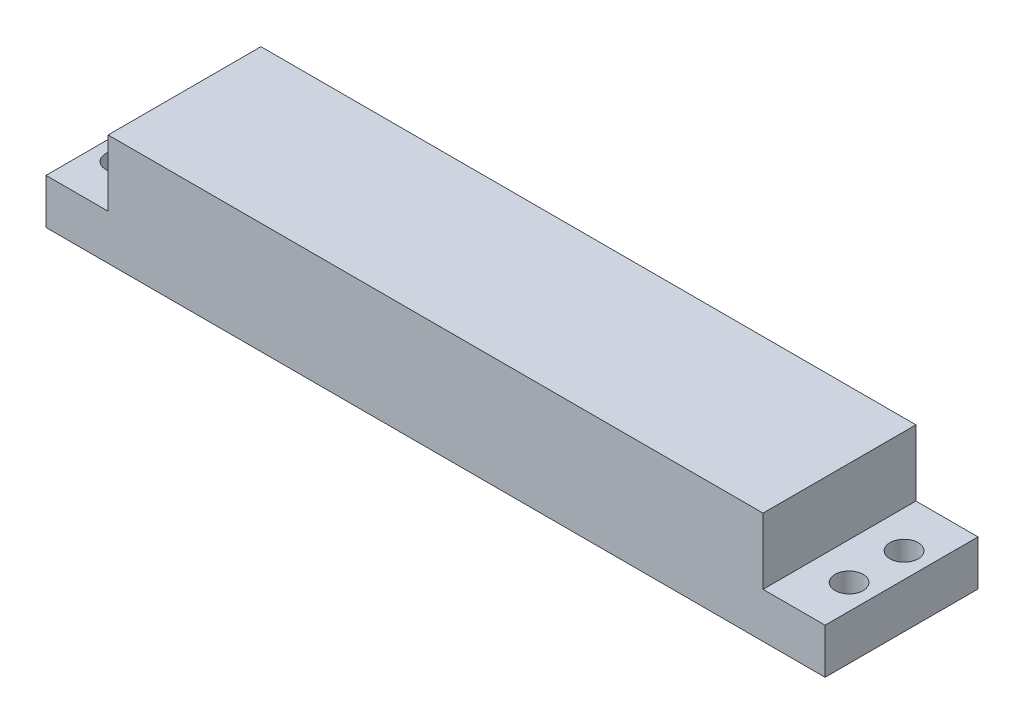
ISO-10303-21;
HEADER;
FILE_DESCRIPTION(('STEP AP214'),'2;1');
FILE_NAME('part.step','',(''),(''),'','','');
FILE_SCHEMA(('AUTOMOTIVE_DESIGN { 1 0 10303 214 1 1 1 1 }'));
ENDSEC;
DATA;
#1=APPLICATION_CONTEXT('core data for automotive mechanical design processes');
#2=APPLICATION_PROTOCOL_DEFINITION('international standard','automotive_design',2000,#1);
#3=PRODUCT_CONTEXT('',#1,'mechanical');
#4=PRODUCT('Part','Part','',(#3));
#5=PRODUCT_RELATED_PRODUCT_CATEGORY('part','',(#4));
#6=PRODUCT_DEFINITION_FORMATION('','',#4);
#7=PRODUCT_DEFINITION_CONTEXT('part definition',#1,'design');
#8=PRODUCT_DEFINITION('design','',#6,#7);
#9=PRODUCT_DEFINITION_SHAPE('','',#8);
#10=(LENGTH_UNIT() NAMED_UNIT(*) SI_UNIT(.MILLI.,.METRE.));
#11=(NAMED_UNIT(*) PLANE_ANGLE_UNIT() SI_UNIT($,.RADIAN.));
#12=(NAMED_UNIT(*) SI_UNIT($,.STERADIAN.) SOLID_ANGLE_UNIT());
#13=UNCERTAINTY_MEASURE_WITH_UNIT(LENGTH_MEASURE(1.E-05),#10,'distance_accuracy_value','');
#14=(GEOMETRIC_REPRESENTATION_CONTEXT(3) GLOBAL_UNCERTAINTY_ASSIGNED_CONTEXT((#13)) GLOBAL_UNIT_ASSIGNED_CONTEXT((#10,
#11,#12)) REPRESENTATION_CONTEXT('',''));
#15=CARTESIAN_POINT('',(0.,0.,0.));
#16=DIRECTION('',(0.,0.,1.));
#17=DIRECTION('',(1.,0.,0.));
#18=AXIS2_PLACEMENT_3D('',#15,#16,#17);
#19=CARTESIAN_POINT('',(0.,6.5,0.));
#20=DIRECTION('',(0.,-1.,0.));
#21=DIRECTION('',(0.,0.,-1.));
#22=AXIS2_PLACEMENT_3D('',#19,#20,#21);
#23=PLANE('',#22);
#24=CARTESIAN_POINT('',(-52.455,6.5,-3.955));
#25=DIRECTION('',(0.,1.,0.));
#26=DIRECTION('',(0.,0.,1.));
#27=AXIS2_PLACEMENT_3D('',#24,#25,#26);
#28=CIRCLE('',#27,2.025);
#29=CARTESIAN_POINT('',(-52.455,6.5,-1.93));
#30=VERTEX_POINT('',#29);
#31=EDGE_CURVE('E166',#30,#30,#28,.T.);
#32=ORIENTED_EDGE('',*,*,#31,.F.);
#33=EDGE_LOOP('',(#32));
#34=FACE_BOUND('',#33,.T.);
#35=CARTESIAN_POINT('',(-52.455,6.5,3.955));
#36=DIRECTION('',(0.,1.,0.));
#37=DIRECTION('',(0.,0.,1.));
#38=AXIS2_PLACEMENT_3D('',#35,#36,#37);
#39=CIRCLE('',#38,2.025);
#40=CARTESIAN_POINT('',(-52.455,6.5,5.98));
#41=VERTEX_POINT('',#40);
#42=EDGE_CURVE('E182',#41,#41,#39,.T.);
#43=ORIENTED_EDGE('',*,*,#42,.F.);
#44=EDGE_LOOP('',(#43));
#45=FACE_BOUND('',#44,.T.);
#46=DIRECTION('',(0.,0.,1.));
#47=VECTOR('',#46,1.);
#48=CARTESIAN_POINT('',(-47.119931018186,6.5,11.));
#49=LINE('',#48,#47);
#50=CARTESIAN_POINT('',(-47.119931018186,6.5,-11.));
#51=VERTEX_POINT('',#50);
#52=CARTESIAN_POINT('',(-47.119931018186,6.5,11.));
#53=VERTEX_POINT('',#52);
#54=EDGE_CURVE('E138',#51,#53,#49,.T.);
#55=ORIENTED_EDGE('',*,*,#54,.F.);
#56=DIRECTION('',(-1.,0.,0.));
#57=VECTOR('',#56,1.);
#58=CARTESIAN_POINT('',(-56.05,6.5,-11.));
#59=LINE('',#58,#57);
#60=CARTESIAN_POINT('',(-56.05,6.5,-11.));
#61=VERTEX_POINT('',#60);
#62=EDGE_CURVE('E120',#51,#61,#59,.T.);
#63=ORIENTED_EDGE('',*,*,#62,.T.);
#64=DIRECTION('',(0.,0.,1.));
#65=VECTOR('',#64,1.);
#66=CARTESIAN_POINT('',(-56.05,6.5,11.));
#67=LINE('',#66,#65);
#68=CARTESIAN_POINT('',(-56.05,6.5,11.));
#69=VERTEX_POINT('',#68);
#70=EDGE_CURVE('E119',#61,#69,#67,.T.);
#71=ORIENTED_EDGE('',*,*,#70,.T.);
#72=DIRECTION('',(1.,0.,0.));
#73=VECTOR('',#72,1.);
#74=CARTESIAN_POINT('',(-56.05,6.5,11.));
#75=LINE('',#74,#73);
#76=EDGE_CURVE('E71',#69,#53,#75,.T.);
#77=ORIENTED_EDGE('',*,*,#76,.T.);
#78=EDGE_LOOP('',(#55,#63,#71,#77));
#79=FACE_BOUND('',#78,.T.);
#80=ADVANCED_FACE('F47',(#34,#45,#79),#23,.F.);
#81=CARTESIAN_POINT('',(52.455,6.5,-3.955));
#82=DIRECTION('',(0.,1.,0.));
#83=DIRECTION('',(0.,0.,1.));
#84=AXIS2_PLACEMENT_3D('',#81,#82,#83);
#85=CIRCLE('',#84,2.025);
#86=CARTESIAN_POINT('',(52.455,6.5,-1.93));
#87=VERTEX_POINT('',#86);
#88=EDGE_CURVE('E156',#87,#87,#85,.T.);
#89=ORIENTED_EDGE('',*,*,#88,.F.);
#90=EDGE_LOOP('',(#89));
#91=FACE_BOUND('',#90,.T.);
#92=CARTESIAN_POINT('',(52.455,6.5,3.955));
#93=DIRECTION('',(0.,1.,0.));
#94=DIRECTION('',(0.,0.,1.));
#95=AXIS2_PLACEMENT_3D('',#92,#93,#94);
#96=CIRCLE('',#95,2.025);
#97=CARTESIAN_POINT('',(52.455,6.5,5.98));
#98=VERTEX_POINT('',#97);
#99=EDGE_CURVE('E174',#98,#98,#96,.T.);
#100=ORIENTED_EDGE('',*,*,#99,.F.);
#101=EDGE_LOOP('',(#100));
#102=FACE_BOUND('',#101,.T.);
#103=DIRECTION('',(0.,0.,-1.));
#104=VECTOR('',#103,1.);
#105=CARTESIAN_POINT('',(47.119931018186,6.5,11.));
#106=LINE('',#105,#104);
#107=CARTESIAN_POINT('',(47.119931018186,6.5,11.));
#108=VERTEX_POINT('',#107);
#109=CARTESIAN_POINT('',(47.119931018186,6.5,-11.));
#110=VERTEX_POINT('',#109);
#111=EDGE_CURVE('E63',#108,#110,#106,.T.);
#112=ORIENTED_EDGE('',*,*,#111,.F.);
#113=CARTESIAN_POINT('',(56.05,6.5,11.));
#114=VERTEX_POINT('',#113);
#115=EDGE_CURVE('E195',#108,#114,#75,.T.);
#116=ORIENTED_EDGE('',*,*,#115,.T.);
#117=DIRECTION('',(0.,0.,-1.));
#118=VECTOR('',#117,1.);
#119=CARTESIAN_POINT('',(56.05,6.5,11.));
#120=LINE('',#119,#118);
#121=CARTESIAN_POINT('',(56.05,6.5,-11.));
#122=VERTEX_POINT('',#121);
#123=EDGE_CURVE('E115',#114,#122,#120,.T.);
#124=ORIENTED_EDGE('',*,*,#123,.T.);
#125=EDGE_CURVE('E111',#122,#110,#59,.T.);
#126=ORIENTED_EDGE('',*,*,#125,.T.);
#127=EDGE_LOOP('',(#112,#116,#124,#126));
#128=FACE_BOUND('',#127,.T.);
#129=ADVANCED_FACE('F113',(#91,#102,#128),#23,.F.);
#130=CARTESIAN_POINT('',(0.,0.,0.));
#131=DIRECTION('',(0.,-1.,0.));
#132=DIRECTION('',(0.,0.,-1.));
#133=AXIS2_PLACEMENT_3D('',#130,#131,#132);
#134=PLANE('',#133);
#135=CARTESIAN_POINT('',(-52.455,0.,-3.955));
#136=DIRECTION('',(0.,1.,0.));
#137=DIRECTION('',(0.,0.,1.));
#138=AXIS2_PLACEMENT_3D('',#135,#136,#137);
#139=CIRCLE('',#138,2.025);
#140=CARTESIAN_POINT('',(-52.455,0.,-1.93));
#141=VERTEX_POINT('',#140);
#142=EDGE_CURVE('E160',#141,#141,#139,.T.);
#143=ORIENTED_EDGE('',*,*,#142,.T.);
#144=EDGE_LOOP('',(#143));
#145=FACE_BOUND('',#144,.T.);
#146=CARTESIAN_POINT('',(-52.455,0.,3.955));
#147=DIRECTION('',(0.,1.,0.));
#148=DIRECTION('',(0.,0.,1.));
#149=AXIS2_PLACEMENT_3D('',#146,#147,#148);
#150=CIRCLE('',#149,2.025);
#151=CARTESIAN_POINT('',(-52.455,0.,5.98));
#152=VERTEX_POINT('',#151);
#153=EDGE_CURVE('E178',#152,#152,#150,.T.);
#154=ORIENTED_EDGE('',*,*,#153,.T.);
#155=EDGE_LOOP('',(#154));
#156=FACE_BOUND('',#155,.T.);
#157=DIRECTION('',(0.,0.,-1.));
#158=VECTOR('',#157,1.);
#159=CARTESIAN_POINT('',(56.05,0.,11.));
#160=LINE('',#159,#158);
#161=CARTESIAN_POINT('',(56.05,0.,11.));
#162=VERTEX_POINT('',#161);
#163=CARTESIAN_POINT('',(56.05,0.,-11.));
#164=VERTEX_POINT('',#163);
#165=EDGE_CURVE('E186',#162,#164,#160,.T.);
#166=ORIENTED_EDGE('',*,*,#165,.F.);
#167=DIRECTION('',(1.,0.,0.));
#168=VECTOR('',#167,1.);
#169=CARTESIAN_POINT('',(-56.05,0.,11.));
#170=LINE('',#169,#168);
#171=CARTESIAN_POINT('',(-56.05,0.,11.));
#172=VERTEX_POINT('',#171);
#173=EDGE_CURVE('E191',#172,#162,#170,.T.);
#174=ORIENTED_EDGE('',*,*,#173,.F.);
#175=DIRECTION('',(0.,0.,1.));
#176=VECTOR('',#175,1.);
#177=CARTESIAN_POINT('',(-56.05,0.,11.));
#178=LINE('',#177,#176);
#179=CARTESIAN_POINT('',(-56.05,0.,-11.));
#180=VERTEX_POINT('',#179);
#181=EDGE_CURVE('E205',#180,#172,#178,.T.);
#182=ORIENTED_EDGE('',*,*,#181,.F.);
#183=DIRECTION('',(-1.,0.,0.));
#184=VECTOR('',#183,1.);
#185=CARTESIAN_POINT('',(-56.05,0.,-11.));
#186=LINE('',#185,#184);
#187=EDGE_CURVE('E202',#164,#180,#186,.T.);
#188=ORIENTED_EDGE('',*,*,#187,.F.);
#189=EDGE_LOOP('',(#166,#174,#182,#188));
#190=FACE_BOUND('',#189,.T.);
#191=CARTESIAN_POINT('',(52.455,0.,3.955));
#192=DIRECTION('',(0.,1.,0.));
#193=DIRECTION('',(0.,0.,1.));
#194=AXIS2_PLACEMENT_3D('',#191,#192,#193);
#195=CIRCLE('',#194,2.025);
#196=CARTESIAN_POINT('',(52.455,0.,5.98));
#197=VERTEX_POINT('',#196);
#198=EDGE_CURVE('E170',#197,#197,#195,.T.);
#199=ORIENTED_EDGE('',*,*,#198,.T.);
#200=EDGE_LOOP('',(#199));
#201=FACE_BOUND('',#200,.T.);
#202=CARTESIAN_POINT('',(52.455,0.,-3.955));
#203=DIRECTION('',(0.,1.,0.));
#204=DIRECTION('',(0.,0.,1.));
#205=AXIS2_PLACEMENT_3D('',#202,#203,#204);
#206=CIRCLE('',#205,2.025);
#207=CARTESIAN_POINT('',(52.455,0.,-1.93));
#208=VERTEX_POINT('',#207);
#209=EDGE_CURVE('E161',#208,#208,#206,.T.);
#210=ORIENTED_EDGE('',*,*,#209,.T.);
#211=EDGE_LOOP('',(#210));
#212=FACE_BOUND('',#211,.T.);
#213=ADVANCED_FACE('F228',(#145,#156,#190,#201,#212),#134,.T.);
#214=CARTESIAN_POINT('',(56.05,6.5,11.));
#215=DIRECTION('',(-1.,0.,0.));
#216=DIRECTION('',(0.,0.,1.));
#217=AXIS2_PLACEMENT_3D('',#214,#215,#216);
#218=PLANE('',#217);
#219=ORIENTED_EDGE('',*,*,#165,.T.);
#220=DIRECTION('',(0.,-1.,0.));
#221=VECTOR('',#220,1.);
#222=CARTESIAN_POINT('',(56.05,6.5,-11.));
#223=LINE('',#222,#221);
#224=EDGE_CURVE('E12',#122,#164,#223,.T.);
#225=ORIENTED_EDGE('',*,*,#224,.F.);
#226=ORIENTED_EDGE('',*,*,#123,.F.);
#227=DIRECTION('',(0.,-1.,0.));
#228=VECTOR('',#227,1.);
#229=CARTESIAN_POINT('',(56.05,6.5,11.));
#230=LINE('',#229,#228);
#231=EDGE_CURVE('E198',#114,#162,#230,.T.);
#232=ORIENTED_EDGE('',*,*,#231,.T.);
#233=EDGE_LOOP('',(#219,#225,#226,#232));
#234=FACE_BOUND('',#233,.T.);
#235=ADVANCED_FACE('F49',(#234),#218,.F.);
#236=CARTESIAN_POINT('',(-56.05,6.5,-11.));
#237=DIRECTION('',(0.,0.,1.));
#238=DIRECTION('',(1.,0.,0.));
#239=AXIS2_PLACEMENT_3D('',#236,#237,#238);
#240=PLANE('',#239);
#241=ORIENTED_EDGE('',*,*,#187,.T.);
#242=DIRECTION('',(0.,-1.,0.));
#243=VECTOR('',#242,1.);
#244=CARTESIAN_POINT('',(-56.05,6.5,-11.));
#245=LINE('',#244,#243);
#246=EDGE_CURVE('E56',#61,#180,#245,.T.);
#247=ORIENTED_EDGE('',*,*,#246,.F.);
#248=ORIENTED_EDGE('',*,*,#62,.F.);
#249=DIRECTION('',(0.,-1.,0.));
#250=VECTOR('',#249,1.);
#251=CARTESIAN_POINT('',(-47.119931018186,128.773713355613,-11.));
#252=LINE('',#251,#250);
#253=CARTESIAN_POINT('',(-47.119931018186,16.,-11.));
#254=VERTEX_POINT('',#253);
#255=EDGE_CURVE('E132',#254,#51,#252,.T.);
#256=ORIENTED_EDGE('',*,*,#255,.F.);
#257=DIRECTION('',(1.,0.,0.));
#258=VECTOR('',#257,1.);
#259=CARTESIAN_POINT('',(47.119931018186,16.,-11.));
#260=LINE('',#259,#258);
#261=CARTESIAN_POINT('',(47.119931018186,16.,-11.));
#262=VERTEX_POINT('',#261);
#263=EDGE_CURVE('E127',#254,#262,#260,.T.);
#264=ORIENTED_EDGE('',*,*,#263,.T.);
#265=DIRECTION('',(0.,-1.,0.));
#266=VECTOR('',#265,1.);
#267=CARTESIAN_POINT('',(47.119931018186,128.773713355613,-11.));
#268=LINE('',#267,#266);
#269=EDGE_CURVE('E124',#262,#110,#268,.T.);
#270=ORIENTED_EDGE('',*,*,#269,.T.);
#271=ORIENTED_EDGE('',*,*,#125,.F.);
#272=ORIENTED_EDGE('',*,*,#224,.T.);
#273=EDGE_LOOP('',(#241,#247,#248,#256,#264,#270,#271,#272));
#274=FACE_BOUND('',#273,.T.);
#275=ADVANCED_FACE('F125',(#274),#240,.F.);
#276=CARTESIAN_POINT('',(-56.05,6.5,11.));
#277=DIRECTION('',(1.,0.,0.));
#278=DIRECTION('',(0.,0.,-1.));
#279=AXIS2_PLACEMENT_3D('',#276,#277,#278);
#280=PLANE('',#279);
#281=ORIENTED_EDGE('',*,*,#181,.T.);
#282=DIRECTION('',(0.,-1.,0.));
#283=VECTOR('',#282,1.);
#284=CARTESIAN_POINT('',(-56.05,6.5,11.));
#285=LINE('',#284,#283);
#286=EDGE_CURVE('E213',#69,#172,#285,.T.);
#287=ORIENTED_EDGE('',*,*,#286,.F.);
#288=ORIENTED_EDGE('',*,*,#70,.F.);
#289=ORIENTED_EDGE('',*,*,#246,.T.);
#290=EDGE_LOOP('',(#281,#287,#288,#289));
#291=FACE_BOUND('',#290,.T.);
#292=ADVANCED_FACE('F222',(#291),#280,.F.);
#293=CARTESIAN_POINT('',(-56.05,6.5,11.));
#294=DIRECTION('',(0.,0.,-1.));
#295=DIRECTION('',(-1.,0.,0.));
#296=AXIS2_PLACEMENT_3D('',#293,#294,#295);
#297=PLANE('',#296);
#298=ORIENTED_EDGE('',*,*,#173,.T.);
#299=ORIENTED_EDGE('',*,*,#231,.F.);
#300=ORIENTED_EDGE('',*,*,#115,.F.);
#301=DIRECTION('',(0.,-1.,0.));
#302=VECTOR('',#301,1.);
#303=CARTESIAN_POINT('',(47.119931018186,128.773713355613,11.));
#304=LINE('',#303,#302);
#305=CARTESIAN_POINT('',(47.119931018186,16.,11.));
#306=VERTEX_POINT('',#305);
#307=EDGE_CURVE('E131',#306,#108,#304,.T.);
#308=ORIENTED_EDGE('',*,*,#307,.F.);
#309=DIRECTION('',(-1.,0.,0.));
#310=VECTOR('',#309,1.);
#311=CARTESIAN_POINT('',(47.119931018186,16.,11.));
#312=LINE('',#311,#310);
#313=CARTESIAN_POINT('',(-47.119931018186,16.,11.));
#314=VERTEX_POINT('',#313);
#315=EDGE_CURVE('E350',#306,#314,#312,.T.);
#316=ORIENTED_EDGE('',*,*,#315,.T.);
#317=DIRECTION('',(0.,-1.,0.));
#318=VECTOR('',#317,1.);
#319=CARTESIAN_POINT('',(-47.119931018186,128.773713355613,11.));
#320=LINE('',#319,#318);
#321=EDGE_CURVE('E150',#314,#53,#320,.T.);
#322=ORIENTED_EDGE('',*,*,#321,.T.);
#323=ORIENTED_EDGE('',*,*,#76,.F.);
#324=ORIENTED_EDGE('',*,*,#286,.T.);
#325=EDGE_LOOP('',(#298,#299,#300,#308,#316,#322,#323,#324));
#326=FACE_BOUND('',#325,.T.);
#327=ADVANCED_FACE('F232',(#326),#297,.F.);
#328=CARTESIAN_POINT('',(-52.455,6.5,3.955));
#329=DIRECTION('',(0.,-1.,0.));
#330=DIRECTION('',(0.,0.,-1.));
#331=AXIS2_PLACEMENT_3D('',#328,#329,#330);
#332=CYLINDRICAL_SURFACE('',#331,2.025);
#333=ORIENTED_EDGE('',*,*,#42,.T.);
#334=EDGE_LOOP('',(#333));
#335=FACE_BOUND('',#334,.T.);
#336=ORIENTED_EDGE('',*,*,#153,.F.);
#337=EDGE_LOOP('',(#336));
#338=FACE_BOUND('',#337,.T.);
#339=ADVANCED_FACE('F253',(#335,#338),#332,.F.);
#340=CARTESIAN_POINT('',(52.455,6.5,3.955));
#341=DIRECTION('',(0.,-1.,0.));
#342=DIRECTION('',(0.,0.,-1.));
#343=AXIS2_PLACEMENT_3D('',#340,#341,#342);
#344=CYLINDRICAL_SURFACE('',#343,2.025);
#345=ORIENTED_EDGE('',*,*,#99,.T.);
#346=EDGE_LOOP('',(#345));
#347=FACE_BOUND('',#346,.T.);
#348=ORIENTED_EDGE('',*,*,#198,.F.);
#349=EDGE_LOOP('',(#348));
#350=FACE_BOUND('',#349,.T.);
#351=ADVANCED_FACE('F269',(#347,#350),#344,.F.);
#352=CARTESIAN_POINT('',(-52.455,6.5,-3.955));
#353=DIRECTION('',(0.,-1.,0.));
#354=DIRECTION('',(0.,0.,-1.));
#355=AXIS2_PLACEMENT_3D('',#352,#353,#354);
#356=CYLINDRICAL_SURFACE('',#355,2.025);
#357=ORIENTED_EDGE('',*,*,#31,.T.);
#358=EDGE_LOOP('',(#357));
#359=FACE_BOUND('',#358,.T.);
#360=ORIENTED_EDGE('',*,*,#142,.F.);
#361=EDGE_LOOP('',(#360));
#362=FACE_BOUND('',#361,.T.);
#363=ADVANCED_FACE('F277',(#359,#362),#356,.F.);
#364=CARTESIAN_POINT('',(52.455,6.5,-3.955));
#365=DIRECTION('',(0.,-1.,0.));
#366=DIRECTION('',(0.,0.,-1.));
#367=AXIS2_PLACEMENT_3D('',#364,#365,#366);
#368=CYLINDRICAL_SURFACE('',#367,2.025);
#369=ORIENTED_EDGE('',*,*,#88,.T.);
#370=EDGE_LOOP('',(#369));
#371=FACE_BOUND('',#370,.T.);
#372=ORIENTED_EDGE('',*,*,#209,.F.);
#373=EDGE_LOOP('',(#372));
#374=FACE_BOUND('',#373,.T.);
#375=ADVANCED_FACE('F284',(#371,#374),#368,.F.);
#376=CARTESIAN_POINT('',(47.119931018186,128.773713355613,11.));
#377=DIRECTION('',(-1.,0.,0.));
#378=DIRECTION('',(0.,0.,1.));
#379=AXIS2_PLACEMENT_3D('',#376,#377,#378);
#380=PLANE('',#379);
#381=ORIENTED_EDGE('',*,*,#269,.F.);
#382=DIRECTION('',(0.,0.,1.));
#383=VECTOR('',#382,1.);
#384=CARTESIAN_POINT('',(47.119931018186,16.,11.));
#385=LINE('',#384,#383);
#386=EDGE_CURVE('E155',#262,#306,#385,.T.);
#387=ORIENTED_EDGE('',*,*,#386,.T.);
#388=ORIENTED_EDGE('',*,*,#307,.T.);
#389=ORIENTED_EDGE('',*,*,#111,.T.);
#390=EDGE_LOOP('',(#381,#387,#388,#389));
#391=FACE_BOUND('',#390,.T.);
#392=ADVANCED_FACE('F135',(#391),#380,.F.);
#393=CARTESIAN_POINT('',(-47.119931018186,128.773713355613,11.));
#394=DIRECTION('',(1.,0.,0.));
#395=DIRECTION('',(0.,0.,-1.));
#396=AXIS2_PLACEMENT_3D('',#393,#394,#395);
#397=PLANE('',#396);
#398=ORIENTED_EDGE('',*,*,#321,.F.);
#399=DIRECTION('',(0.,0.,-1.));
#400=VECTOR('',#399,1.);
#401=CARTESIAN_POINT('',(-47.119931018186,16.,11.));
#402=LINE('',#401,#400);
#403=EDGE_CURVE('E165',#314,#254,#402,.T.);
#404=ORIENTED_EDGE('',*,*,#403,.T.);
#405=ORIENTED_EDGE('',*,*,#255,.T.);
#406=ORIENTED_EDGE('',*,*,#54,.T.);
#407=EDGE_LOOP('',(#398,#404,#405,#406));
#408=FACE_BOUND('',#407,.T.);
#409=ADVANCED_FACE('F327',(#408),#397,.F.);
#410=CARTESIAN_POINT('',(0.,16.,0.));
#411=DIRECTION('',(0.,-1.,0.));
#412=DIRECTION('',(0.,0.,-1.));
#413=AXIS2_PLACEMENT_3D('',#410,#411,#412);
#414=PLANE('',#413);
#415=ORIENTED_EDGE('',*,*,#315,.F.);
#416=ORIENTED_EDGE('',*,*,#386,.F.);
#417=ORIENTED_EDGE('',*,*,#263,.F.);
#418=ORIENTED_EDGE('',*,*,#403,.F.);
#419=EDGE_LOOP('',(#415,#416,#417,#418));
#420=FACE_BOUND('',#419,.T.);
#421=ADVANCED_FACE('F336',(#420),#414,.F.);
#422=CLOSED_SHELL('',(#80,#129,#213,#235,#275,#292,#327,#339,#351,#363,#375,#392,#409,#421));
#423=MANIFOLD_SOLID_BREP('B2',#422);
#424=ADVANCED_BREP_SHAPE_REPRESENTATION('',(#18,#423),#14);
#425=SHAPE_DEFINITION_REPRESENTATION(#9,#424);
ENDSEC;
END-ISO-10303-21;
